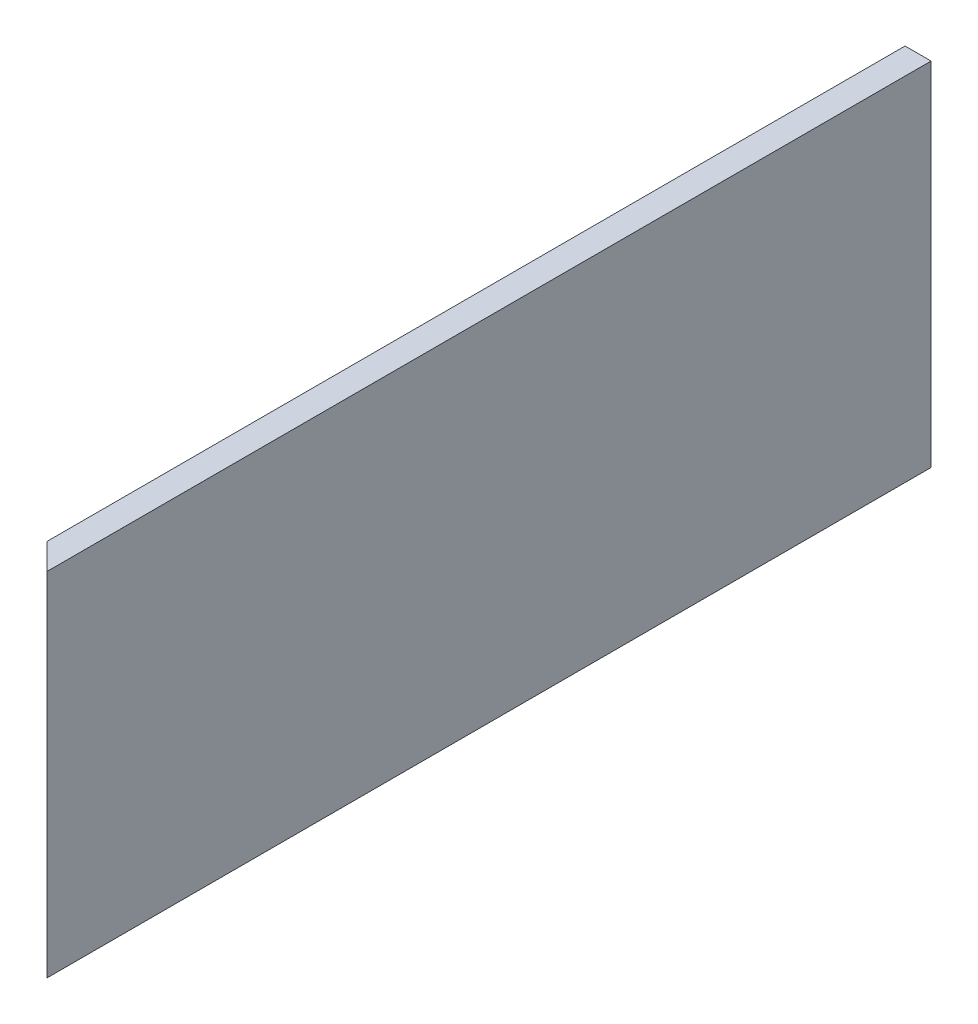
ISO-10303-21;
HEADER;
FILE_DESCRIPTION(('STEP AP214'),'2;1');
FILE_NAME('part.step','',(''),(''),'','','');
FILE_SCHEMA(('AUTOMOTIVE_DESIGN { 1 0 10303 214 1 1 1 1 }'));
ENDSEC;
DATA;
#1=APPLICATION_CONTEXT('core data for automotive mechanical design processes');
#2=APPLICATION_PROTOCOL_DEFINITION('international standard','automotive_design',2000,#1);
#3=PRODUCT_CONTEXT('',#1,'mechanical');
#4=PRODUCT('Part','Part','',(#3));
#5=PRODUCT_RELATED_PRODUCT_CATEGORY('part','',(#4));
#6=PRODUCT_DEFINITION_FORMATION('','',#4);
#7=PRODUCT_DEFINITION_CONTEXT('part definition',#1,'design');
#8=PRODUCT_DEFINITION('design','',#6,#7);
#9=PRODUCT_DEFINITION_SHAPE('','',#8);
#10=(LENGTH_UNIT() NAMED_UNIT(*) SI_UNIT(.MILLI.,.METRE.));
#11=(NAMED_UNIT(*) PLANE_ANGLE_UNIT() SI_UNIT($,.RADIAN.));
#12=(NAMED_UNIT(*) SI_UNIT($,.STERADIAN.) SOLID_ANGLE_UNIT());
#13=UNCERTAINTY_MEASURE_WITH_UNIT(LENGTH_MEASURE(1.E-05),#10,'distance_accuracy_value','');
#14=(GEOMETRIC_REPRESENTATION_CONTEXT(3) GLOBAL_UNCERTAINTY_ASSIGNED_CONTEXT((#13)) GLOBAL_UNIT_ASSIGNED_CONTEXT((#10,
#11,#12)) REPRESENTATION_CONTEXT('',''));
#15=CARTESIAN_POINT('',(0.,0.,0.));
#16=DIRECTION('',(0.,0.,1.));
#17=DIRECTION('',(1.,0.,0.));
#18=AXIS2_PLACEMENT_3D('',#15,#16,#17);
#19=CARTESIAN_POINT('',(418.642799999999,171.7294,632.854613805219));
#20=DIRECTION('',(1.,0.,0.));
#21=DIRECTION('',(0.,1.,0.));
#22=AXIS2_PLACEMENT_3D('',#19,#20,#21);
#23=PLANE('',#22);
#24=DIRECTION('',(0.,-1.,0.));
#25=VECTOR('',#24,1.);
#26=CARTESIAN_POINT('',(418.642799999999,171.729399999998,418.642799999999));
#27=LINE('',#26,#25);
#28=CARTESIAN_POINT('',(418.642799999999,171.7294,418.642799999999));
#29=VERTEX_POINT('',#28);
#30=CARTESIAN_POINT('',(418.6428,0.,418.6428));
#31=VERTEX_POINT('',#30);
#32=EDGE_CURVE('E90',#29,#31,#27,.T.);
#33=ORIENTED_EDGE('',*,*,#32,.F.);
#34=DIRECTION('',(0.,0.,-1.));
#35=VECTOR('',#34,1.);
#36=CARTESIAN_POINT('',(418.642799999999,171.7294,632.854613805219));
#37=LINE('',#36,#35);
#38=CARTESIAN_POINT('',(418.642799999999,171.7294,0.));
#39=VERTEX_POINT('',#38);
#40=EDGE_CURVE('E43',#29,#39,#37,.T.);
#41=ORIENTED_EDGE('',*,*,#40,.T.);
#42=DIRECTION('',(0.,-1.,0.));
#43=VECTOR('',#42,1.);
#44=CARTESIAN_POINT('',(418.642799999999,171.7294,0.));
#45=LINE('',#44,#43);
#46=CARTESIAN_POINT('',(418.6428,0.,0.));
#47=VERTEX_POINT('',#46);
#48=EDGE_CURVE('E88',#39,#47,#45,.T.);
#49=ORIENTED_EDGE('',*,*,#48,.T.);
#50=DIRECTION('',(0.,0.,-1.));
#51=VECTOR('',#50,1.);
#52=CARTESIAN_POINT('',(418.6428,0.,632.854613805219));
#53=LINE('',#52,#51);
#54=EDGE_CURVE('E79',#31,#47,#53,.T.);
#55=ORIENTED_EDGE('',*,*,#54,.F.);
#56=EDGE_LOOP('',(#33,#41,#49,#55));
#57=FACE_BOUND('',#56,.T.);
#58=ADVANCED_FACE('F39',(#57),#23,.F.);
#59=CARTESIAN_POINT('',(418.6428,0.,632.854613805219));
#60=DIRECTION('',(0.,1.,0.));
#61=DIRECTION('',(0.,0.,1.));
#62=AXIS2_PLACEMENT_3D('',#59,#60,#61);
#63=PLANE('',#62);
#64=DIRECTION('',(0.707106781186548,0.,0.707106781186547));
#65=VECTOR('',#64,1.);
#66=CARTESIAN_POINT('',(525.748706902609,0.,525.748706902609));
#67=LINE('',#66,#65);
#68=CARTESIAN_POINT('',(431.3428,0.,431.342799999999));
#69=VERTEX_POINT('',#68);
#70=EDGE_CURVE('E49',#31,#69,#67,.T.);
#71=ORIENTED_EDGE('',*,*,#70,.F.);
#72=ORIENTED_EDGE('',*,*,#54,.T.);
#73=DIRECTION('',(1.,0.,0.));
#74=VECTOR('',#73,1.);
#75=CARTESIAN_POINT('',(418.6428,0.,0.));
#76=LINE('',#75,#74);
#77=CARTESIAN_POINT('',(431.3428,0.,0.));
#78=VERTEX_POINT('',#77);
#79=EDGE_CURVE('E102',#47,#78,#76,.T.);
#80=ORIENTED_EDGE('',*,*,#79,.T.);
#81=DIRECTION('',(0.,0.,-1.));
#82=VECTOR('',#81,1.);
#83=CARTESIAN_POINT('',(431.3428,0.,632.854613805219));
#84=LINE('',#83,#82);
#85=EDGE_CURVE('E116',#69,#78,#84,.T.);
#86=ORIENTED_EDGE('',*,*,#85,.F.);
#87=EDGE_LOOP('',(#71,#72,#80,#86));
#88=FACE_BOUND('',#87,.T.);
#89=ADVANCED_FACE('F123',(#88),#63,.F.);
#90=CARTESIAN_POINT('',(431.3428,0.,632.854613805219));
#91=DIRECTION('',(-1.,0.,0.));
#92=DIRECTION('',(0.,-1.,0.));
#93=AXIS2_PLACEMENT_3D('',#90,#91,#92);
#94=PLANE('',#93);
#95=DIRECTION('',(0.,1.,0.));
#96=VECTOR('',#95,1.);
#97=CARTESIAN_POINT('',(431.3428,-1.49817977430545E-12,431.3428));
#98=LINE('',#97,#96);
#99=CARTESIAN_POINT('',(431.342799999999,171.7294,431.342799999998));
#100=VERTEX_POINT('',#99);
#101=EDGE_CURVE('E11',#69,#100,#98,.T.);
#102=ORIENTED_EDGE('',*,*,#101,.F.);
#103=ORIENTED_EDGE('',*,*,#85,.T.);
#104=DIRECTION('',(0.,1.,0.));
#105=VECTOR('',#104,1.);
#106=CARTESIAN_POINT('',(431.3428,0.,0.));
#107=LINE('',#106,#105);
#108=CARTESIAN_POINT('',(431.342799999999,171.7294,0.));
#109=VERTEX_POINT('',#108);
#110=EDGE_CURVE('E118',#78,#109,#107,.T.);
#111=ORIENTED_EDGE('',*,*,#110,.T.);
#112=DIRECTION('',(0.,0.,-1.));
#113=VECTOR('',#112,1.);
#114=CARTESIAN_POINT('',(431.342799999999,171.7294,632.854613805219));
#115=LINE('',#114,#113);
#116=EDGE_CURVE('E62',#100,#109,#115,.T.);
#117=ORIENTED_EDGE('',*,*,#116,.F.);
#118=EDGE_LOOP('',(#102,#103,#111,#117));
#119=FACE_BOUND('',#118,.T.);
#120=ADVANCED_FACE('F122',(#119),#94,.F.);
#121=CARTESIAN_POINT('',(431.342799999999,171.7294,632.854613805219));
#122=DIRECTION('',(0.,-1.,0.));
#123=DIRECTION('',(0.,0.,-1.));
#124=AXIS2_PLACEMENT_3D('',#121,#122,#123);
#125=PLANE('',#124);
#126=DIRECTION('',(-0.707106781186548,0.,-0.707106781186547));
#127=VECTOR('',#126,1.);
#128=CARTESIAN_POINT('',(532.098706902609,171.7294,532.098706902609));
#129=LINE('',#128,#127);
#130=EDGE_CURVE('E99',#100,#29,#129,.T.);
#131=ORIENTED_EDGE('',*,*,#130,.F.);
#132=ORIENTED_EDGE('',*,*,#116,.T.);
#133=DIRECTION('',(-1.,0.,0.));
#134=VECTOR('',#133,1.);
#135=CARTESIAN_POINT('',(431.342799999999,171.7294,0.));
#136=LINE('',#135,#134);
#137=EDGE_CURVE('E94',#109,#39,#136,.T.);
#138=ORIENTED_EDGE('',*,*,#137,.T.);
#139=ORIENTED_EDGE('',*,*,#40,.F.);
#140=EDGE_LOOP('',(#131,#132,#138,#139));
#141=FACE_BOUND('',#140,.T.);
#142=ADVANCED_FACE('F95',(#141),#125,.F.);
#143=CARTESIAN_POINT('',(0.,0.,0.));
#144=DIRECTION('',(0.,0.,1.));
#145=DIRECTION('',(1.,0.,0.));
#146=AXIS2_PLACEMENT_3D('',#143,#144,#145);
#147=PLANE('',#146);
#148=ORIENTED_EDGE('',*,*,#48,.F.);
#149=ORIENTED_EDGE('',*,*,#137,.F.);
#150=ORIENTED_EDGE('',*,*,#110,.F.);
#151=ORIENTED_EDGE('',*,*,#79,.F.);
#152=EDGE_LOOP('',(#148,#149,#150,#151));
#153=FACE_BOUND('',#152,.T.);
#154=ADVANCED_FACE('F101',(#153),#147,.F.);
#155=CARTESIAN_POINT('',(0.,0.,0.));
#156=DIRECTION('',(-0.707106781186547,0.,0.707106781186548));
#157=DIRECTION('',(0.707106781186548,0.,0.707106781186547));
#158=AXIS2_PLACEMENT_3D('',#155,#156,#157);
#159=PLANE('',#158);
#160=ORIENTED_EDGE('',*,*,#130,.T.);
#161=ORIENTED_EDGE('',*,*,#32,.T.);
#162=ORIENTED_EDGE('',*,*,#70,.T.);
#163=ORIENTED_EDGE('',*,*,#101,.T.);
#164=EDGE_LOOP('',(#160,#161,#162,#163));
#165=FACE_BOUND('',#164,.T.);
#166=ADVANCED_FACE('F41',(#165),#159,.T.);
#167=CLOSED_SHELL('',(#58,#89,#120,#142,#154,#166));
#168=MANIFOLD_SOLID_BREP('B2',#167);
#169=ADVANCED_BREP_SHAPE_REPRESENTATION('',(#18,#168),#14);
#170=SHAPE_DEFINITION_REPRESENTATION(#9,#169);
ENDSEC;
END-ISO-10303-21;
